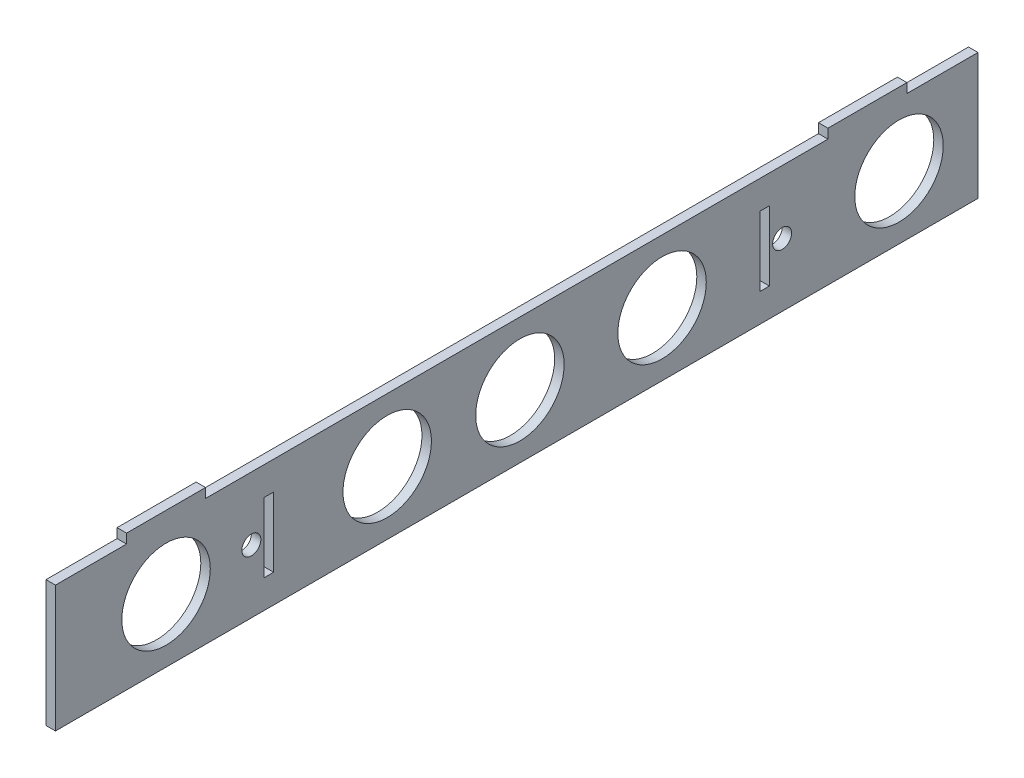
ISO-10303-21;
HEADER;
FILE_DESCRIPTION(('STEP AP214'),'2;1');
FILE_NAME('part.step','',(''),(''),'','','');
FILE_SCHEMA(('AUTOMOTIVE_DESIGN { 1 0 10303 214 1 1 1 1 }'));
ENDSEC;
DATA;
#1=APPLICATION_CONTEXT('core data for automotive mechanical design processes');
#2=APPLICATION_PROTOCOL_DEFINITION('international standard','automotive_design',2000,#1);
#3=PRODUCT_CONTEXT('',#1,'mechanical');
#4=PRODUCT('Part','Part','',(#3));
#5=PRODUCT_RELATED_PRODUCT_CATEGORY('part','',(#4));
#6=PRODUCT_DEFINITION_FORMATION('','',#4);
#7=PRODUCT_DEFINITION_CONTEXT('part definition',#1,'design');
#8=PRODUCT_DEFINITION('design','',#6,#7);
#9=PRODUCT_DEFINITION_SHAPE('','',#8);
#10=(LENGTH_UNIT() NAMED_UNIT(*) SI_UNIT(.MILLI.,.METRE.));
#11=(NAMED_UNIT(*) PLANE_ANGLE_UNIT() SI_UNIT($,.RADIAN.));
#12=(NAMED_UNIT(*) SI_UNIT($,.STERADIAN.) SOLID_ANGLE_UNIT());
#13=UNCERTAINTY_MEASURE_WITH_UNIT(LENGTH_MEASURE(1.E-05),#10,'distance_accuracy_value','');
#14=(GEOMETRIC_REPRESENTATION_CONTEXT(3) GLOBAL_UNCERTAINTY_ASSIGNED_CONTEXT((#13)) GLOBAL_UNIT_ASSIGNED_CONTEXT((#10,
#11,#12)) REPRESENTATION_CONTEXT('',''));
#15=CARTESIAN_POINT('',(0.,0.,0.));
#16=DIRECTION('',(0.,0.,1.));
#17=DIRECTION('',(1.,0.,0.));
#18=AXIS2_PLACEMENT_3D('',#15,#16,#17);
#19=CARTESIAN_POINT('',(3.,-9.,0.));
#20=DIRECTION('',(0.,1.,0.));
#21=DIRECTION('',(0.,0.,1.));
#22=AXIS2_PLACEMENT_3D('',#19,#20,#21);
#23=PLANE('',#22);
#24=DIRECTION('',(0.,0.,-1.));
#25=VECTOR('',#24,1.);
#26=CARTESIAN_POINT('',(0.,-9.,0.));
#27=LINE('',#26,#25);
#28=CARTESIAN_POINT('',(0.,-9.,-222.96));
#29=VERTEX_POINT('',#28);
#30=CARTESIAN_POINT('',(0.,-9.,-225.96));
#31=VERTEX_POINT('',#30);
#32=EDGE_CURVE('E251',#29,#31,#27,.T.);
#33=ORIENTED_EDGE('',*,*,#32,.T.);
#34=DIRECTION('',(-1.,0.,0.));
#35=VECTOR('',#34,1.);
#36=CARTESIAN_POINT('',(3.,-9.,-225.96));
#37=LINE('',#36,#35);
#38=CARTESIAN_POINT('',(3.,-9.,-225.96));
#39=VERTEX_POINT('',#38);
#40=EDGE_CURVE('E11',#39,#31,#37,.T.);
#41=ORIENTED_EDGE('',*,*,#40,.F.);
#42=DIRECTION('',(0.,0.,-1.));
#43=VECTOR('',#42,1.);
#44=CARTESIAN_POINT('',(3.,-9.,0.));
#45=LINE('',#44,#43);
#46=CARTESIAN_POINT('',(3.,-9.,-222.96));
#47=VERTEX_POINT('',#46);
#48=EDGE_CURVE('E190',#47,#39,#45,.T.);
#49=ORIENTED_EDGE('',*,*,#48,.F.);
#50=DIRECTION('',(-1.,0.,0.));
#51=VECTOR('',#50,1.);
#52=CARTESIAN_POINT('',(3.,-9.,-222.96));
#53=LINE('',#52,#51);
#54=EDGE_CURVE('E57',#47,#29,#53,.T.);
#55=ORIENTED_EDGE('',*,*,#54,.T.);
#56=EDGE_LOOP('',(#33,#41,#49,#55));
#57=FACE_BOUND('',#56,.T.);
#58=ADVANCED_FACE('F38',(#57),#23,.F.);
#59=CARTESIAN_POINT('',(3.,0.,-225.96));
#60=DIRECTION('',(0.,0.,-1.));
#61=DIRECTION('',(-1.,0.,0.));
#62=AXIS2_PLACEMENT_3D('',#59,#60,#61);
#63=PLANE('',#62);
#64=DIRECTION('',(0.,-1.,0.));
#65=VECTOR('',#64,1.);
#66=CARTESIAN_POINT('',(0.,0.,-225.96));
#67=LINE('',#66,#65);
#68=CARTESIAN_POINT('',(0.,-31.,-225.96));
#69=VERTEX_POINT('',#68);
#70=EDGE_CURVE('E196',#31,#69,#67,.T.);
#71=ORIENTED_EDGE('',*,*,#70,.T.);
#72=DIRECTION('',(-1.,0.,0.));
#73=VECTOR('',#72,1.);
#74=CARTESIAN_POINT('',(3.,-31.,-225.96));
#75=LINE('',#74,#73);
#76=CARTESIAN_POINT('',(3.,-31.,-225.96));
#77=VERTEX_POINT('',#76);
#78=EDGE_CURVE('E48',#77,#69,#75,.T.);
#79=ORIENTED_EDGE('',*,*,#78,.F.);
#80=DIRECTION('',(0.,-1.,0.));
#81=VECTOR('',#80,1.);
#82=CARTESIAN_POINT('',(3.,0.,-225.96));
#83=LINE('',#82,#81);
#84=EDGE_CURVE('E184',#39,#77,#83,.T.);
#85=ORIENTED_EDGE('',*,*,#84,.F.);
#86=ORIENTED_EDGE('',*,*,#40,.T.);
#87=EDGE_LOOP('',(#71,#79,#85,#86));
#88=FACE_BOUND('',#87,.T.);
#89=ADVANCED_FACE('F195',(#88),#63,.F.);
#90=CARTESIAN_POINT('',(3.,-31.,0.));
#91=DIRECTION('',(0.,1.,0.));
#92=DIRECTION('',(0.,0.,1.));
#93=AXIS2_PLACEMENT_3D('',#90,#91,#92);
#94=PLANE('',#93);
#95=DIRECTION('',(0.,0.,-1.));
#96=VECTOR('',#95,1.);
#97=CARTESIAN_POINT('',(0.,-31.,0.));
#98=LINE('',#97,#96);
#99=CARTESIAN_POINT('',(0.,-31.,-222.96));
#100=VERTEX_POINT('',#99);
#101=EDGE_CURVE('E254',#100,#69,#98,.T.);
#102=ORIENTED_EDGE('',*,*,#101,.F.);
#103=DIRECTION('',(-1.,0.,0.));
#104=VECTOR('',#103,1.);
#105=CARTESIAN_POINT('',(3.,-31.,-222.96));
#106=LINE('',#105,#104);
#107=CARTESIAN_POINT('',(3.,-31.,-222.96));
#108=VERTEX_POINT('',#107);
#109=EDGE_CURVE('E119',#108,#100,#106,.T.);
#110=ORIENTED_EDGE('',*,*,#109,.F.);
#111=DIRECTION('',(0.,0.,-1.));
#112=VECTOR('',#111,1.);
#113=CARTESIAN_POINT('',(3.,-31.,0.));
#114=LINE('',#113,#112);
#115=EDGE_CURVE('E189',#108,#77,#114,.T.);
#116=ORIENTED_EDGE('',*,*,#115,.T.);
#117=ORIENTED_EDGE('',*,*,#78,.T.);
#118=EDGE_LOOP('',(#102,#110,#116,#117));
#119=FACE_BOUND('',#118,.T.);
#120=ADVANCED_FACE('F200',(#119),#94,.T.);
#121=CARTESIAN_POINT('',(3.,-9.,0.));
#122=DIRECTION('',(0.,1.,0.));
#123=DIRECTION('',(0.,0.,1.));
#124=AXIS2_PLACEMENT_3D('',#121,#122,#123);
#125=PLANE('',#124);
#126=DIRECTION('',(0.,0.,-1.));
#127=VECTOR('',#126,1.);
#128=CARTESIAN_POINT('',(0.,-9.,0.));
#129=LINE('',#128,#127);
#130=CARTESIAN_POINT('',(0.,-9.,-66.04));
#131=VERTEX_POINT('',#130);
#132=CARTESIAN_POINT('',(0.,-9.,-69.04));
#133=VERTEX_POINT('',#132);
#134=EDGE_CURVE('E239',#131,#133,#129,.T.);
#135=ORIENTED_EDGE('',*,*,#134,.T.);
#136=DIRECTION('',(-1.,0.,0.));
#137=VECTOR('',#136,1.);
#138=CARTESIAN_POINT('',(3.,-9.,-69.04));
#139=LINE('',#138,#137);
#140=CARTESIAN_POINT('',(3.,-9.,-69.04));
#141=VERTEX_POINT('',#140);
#142=EDGE_CURVE('E261',#141,#133,#139,.T.);
#143=ORIENTED_EDGE('',*,*,#142,.F.);
#144=DIRECTION('',(0.,0.,-1.));
#145=VECTOR('',#144,1.);
#146=CARTESIAN_POINT('',(3.,-9.,0.));
#147=LINE('',#146,#145);
#148=CARTESIAN_POINT('',(3.,-9.,-66.04));
#149=VERTEX_POINT('',#148);
#150=EDGE_CURVE('E362',#149,#141,#147,.T.);
#151=ORIENTED_EDGE('',*,*,#150,.F.);
#152=DIRECTION('',(-1.,0.,0.));
#153=VECTOR('',#152,1.);
#154=CARTESIAN_POINT('',(3.,-9.,-66.04));
#155=LINE('',#154,#153);
#156=EDGE_CURVE('E263',#149,#131,#155,.T.);
#157=ORIENTED_EDGE('',*,*,#156,.T.);
#158=EDGE_LOOP('',(#135,#143,#151,#157));
#159=FACE_BOUND('',#158,.T.);
#160=ADVANCED_FACE('F389',(#159),#125,.F.);
#161=CARTESIAN_POINT('',(3.,0.,-69.04));
#162=DIRECTION('',(0.,0.,-1.));
#163=DIRECTION('',(-1.,0.,0.));
#164=AXIS2_PLACEMENT_3D('',#161,#162,#163);
#165=PLANE('',#164);
#166=DIRECTION('',(0.,-1.,0.));
#167=VECTOR('',#166,1.);
#168=CARTESIAN_POINT('',(0.,0.,-69.04));
#169=LINE('',#168,#167);
#170=CARTESIAN_POINT('',(0.,-31.,-69.04));
#171=VERTEX_POINT('',#170);
#172=EDGE_CURVE('E242',#133,#171,#169,.T.);
#173=ORIENTED_EDGE('',*,*,#172,.T.);
#174=DIRECTION('',(-1.,0.,0.));
#175=VECTOR('',#174,1.);
#176=CARTESIAN_POINT('',(3.,-31.,-69.04));
#177=LINE('',#176,#175);
#178=CARTESIAN_POINT('',(3.,-31.,-69.04));
#179=VERTEX_POINT('',#178);
#180=EDGE_CURVE('E267',#179,#171,#177,.T.);
#181=ORIENTED_EDGE('',*,*,#180,.F.);
#182=DIRECTION('',(0.,-1.,0.));
#183=VECTOR('',#182,1.);
#184=CARTESIAN_POINT('',(3.,0.,-69.04));
#185=LINE('',#184,#183);
#186=EDGE_CURVE('E365',#141,#179,#185,.T.);
#187=ORIENTED_EDGE('',*,*,#186,.F.);
#188=ORIENTED_EDGE('',*,*,#142,.T.);
#189=EDGE_LOOP('',(#173,#181,#187,#188));
#190=FACE_BOUND('',#189,.T.);
#191=ADVANCED_FACE('F391',(#190),#165,.F.);
#192=CARTESIAN_POINT('',(3.,-31.,0.));
#193=DIRECTION('',(0.,1.,0.));
#194=DIRECTION('',(0.,0.,1.));
#195=AXIS2_PLACEMENT_3D('',#192,#193,#194);
#196=PLANE('',#195);
#197=DIRECTION('',(0.,0.,-1.));
#198=VECTOR('',#197,1.);
#199=CARTESIAN_POINT('',(0.,-31.,0.));
#200=LINE('',#199,#198);
#201=CARTESIAN_POINT('',(0.,-31.,-66.04));
#202=VERTEX_POINT('',#201);
#203=EDGE_CURVE('E245',#202,#171,#200,.T.);
#204=ORIENTED_EDGE('',*,*,#203,.F.);
#205=DIRECTION('',(-1.,0.,0.));
#206=VECTOR('',#205,1.);
#207=CARTESIAN_POINT('',(3.,-31.,-66.04));
#208=LINE('',#207,#206);
#209=CARTESIAN_POINT('',(3.,-31.,-66.04));
#210=VERTEX_POINT('',#209);
#211=EDGE_CURVE('E265',#210,#202,#208,.T.);
#212=ORIENTED_EDGE('',*,*,#211,.F.);
#213=DIRECTION('',(0.,0.,-1.));
#214=VECTOR('',#213,1.);
#215=CARTESIAN_POINT('',(3.,-31.,0.));
#216=LINE('',#215,#214);
#217=EDGE_CURVE('E367',#210,#179,#216,.T.);
#218=ORIENTED_EDGE('',*,*,#217,.T.);
#219=ORIENTED_EDGE('',*,*,#180,.T.);
#220=EDGE_LOOP('',(#204,#212,#218,#219));
#221=FACE_BOUND('',#220,.T.);
#222=ADVANCED_FACE('F383',(#221),#196,.T.);
#223=CARTESIAN_POINT('',(3.,0.,-292.));
#224=DIRECTION('',(0.,0.,-1.));
#225=DIRECTION('',(-1.,0.,0.));
#226=AXIS2_PLACEMENT_3D('',#223,#224,#225);
#227=PLANE('',#226);
#228=DIRECTION('',(0.,-1.,0.));
#229=VECTOR('',#228,1.);
#230=CARTESIAN_POINT('',(0.,0.,-292.));
#231=LINE('',#230,#229);
#232=CARTESIAN_POINT('',(0.,0.,-292.));
#233=VERTEX_POINT('',#232);
#234=CARTESIAN_POINT('',(0.,-40.,-292.));
#235=VERTEX_POINT('',#234);
#236=EDGE_CURVE('E207',#233,#235,#231,.T.);
#237=ORIENTED_EDGE('',*,*,#236,.F.);
#238=DIRECTION('',(-1.,0.,0.));
#239=VECTOR('',#238,1.);
#240=CARTESIAN_POINT('',(3.,0.,-292.));
#241=LINE('',#240,#239);
#242=CARTESIAN_POINT('',(3.,0.,-292.));
#243=VERTEX_POINT('',#242);
#244=EDGE_CURVE('E131',#243,#233,#241,.T.);
#245=ORIENTED_EDGE('',*,*,#244,.F.);
#246=DIRECTION('',(0.,-1.,0.));
#247=VECTOR('',#246,1.);
#248=CARTESIAN_POINT('',(3.,0.,-292.));
#249=LINE('',#248,#247);
#250=CARTESIAN_POINT('',(3.,-40.,-292.));
#251=VERTEX_POINT('',#250);
#252=EDGE_CURVE('E259',#243,#251,#249,.T.);
#253=ORIENTED_EDGE('',*,*,#252,.T.);
#254=DIRECTION('',(-1.,0.,0.));
#255=VECTOR('',#254,1.);
#256=CARTESIAN_POINT('',(3.,-40.,-292.));
#257=LINE('',#256,#255);
#258=EDGE_CURVE('E203',#251,#235,#257,.T.);
#259=ORIENTED_EDGE('',*,*,#258,.T.);
#260=EDGE_LOOP('',(#237,#245,#253,#259));
#261=FACE_BOUND('',#260,.T.);
#262=ADVANCED_FACE('F40',(#261),#227,.T.);
#263=CARTESIAN_POINT('',(3.,0.,0.));
#264=DIRECTION('',(0.,1.,0.));
#265=DIRECTION('',(0.,0.,1.));
#266=AXIS2_PLACEMENT_3D('',#263,#264,#265);
#267=PLANE('',#266);
#268=DIRECTION('',(0.,0.,-1.));
#269=VECTOR('',#268,1.);
#270=CARTESIAN_POINT('',(0.,0.,0.));
#271=LINE('',#270,#269);
#272=CARTESIAN_POINT('',(0.,0.,-269.5));
#273=VERTEX_POINT('',#272);
#274=EDGE_CURVE('E210',#273,#233,#271,.T.);
#275=ORIENTED_EDGE('',*,*,#274,.F.);
#276=DIRECTION('',(-1.,0.,0.));
#277=VECTOR('',#276,1.);
#278=CARTESIAN_POINT('',(3.,0.,-269.5));
#279=LINE('',#278,#277);
#280=CARTESIAN_POINT('',(3.,0.,-269.5));
#281=VERTEX_POINT('',#280);
#282=EDGE_CURVE('E291',#281,#273,#279,.T.);
#283=ORIENTED_EDGE('',*,*,#282,.F.);
#284=DIRECTION('',(0.,0.,-1.));
#285=VECTOR('',#284,1.);
#286=CARTESIAN_POINT('',(3.,0.,0.));
#287=LINE('',#286,#285);
#288=EDGE_CURVE('E337',#281,#243,#287,.T.);
#289=ORIENTED_EDGE('',*,*,#288,.T.);
#290=ORIENTED_EDGE('',*,*,#244,.T.);
#291=EDGE_LOOP('',(#275,#283,#289,#290));
#292=FACE_BOUND('',#291,.T.);
#293=ADVANCED_FACE('F427',(#292),#267,.T.);
#294=CARTESIAN_POINT('',(3.,0.,-269.5));
#295=DIRECTION('',(0.,0.,1.));
#296=DIRECTION('',(1.,0.,0.));
#297=AXIS2_PLACEMENT_3D('',#294,#295,#296);
#298=PLANE('',#297);
#299=DIRECTION('',(0.,1.,0.));
#300=VECTOR('',#299,1.);
#301=CARTESIAN_POINT('',(0.,0.,-269.5));
#302=LINE('',#301,#300);
#303=CARTESIAN_POINT('',(0.,3.,-269.5));
#304=VERTEX_POINT('',#303);
#305=EDGE_CURVE('E214',#273,#304,#302,.T.);
#306=ORIENTED_EDGE('',*,*,#305,.T.);
#307=DIRECTION('',(-1.,0.,0.));
#308=VECTOR('',#307,1.);
#309=CARTESIAN_POINT('',(3.,3.,-269.5));
#310=LINE('',#309,#308);
#311=CARTESIAN_POINT('',(3.,3.,-269.5));
#312=VERTEX_POINT('',#311);
#313=EDGE_CURVE('E289',#312,#304,#310,.T.);
#314=ORIENTED_EDGE('',*,*,#313,.F.);
#315=DIRECTION('',(0.,1.,0.));
#316=VECTOR('',#315,1.);
#317=CARTESIAN_POINT('',(3.,0.,-269.5));
#318=LINE('',#317,#316);
#319=EDGE_CURVE('E340',#281,#312,#318,.T.);
#320=ORIENTED_EDGE('',*,*,#319,.F.);
#321=ORIENTED_EDGE('',*,*,#282,.T.);
#322=EDGE_LOOP('',(#306,#314,#320,#321));
#323=FACE_BOUND('',#322,.T.);
#324=ADVANCED_FACE('F447',(#323),#298,.F.);
#325=CARTESIAN_POINT('',(3.,2.99999999999997,0.));
#326=DIRECTION('',(0.,1.,0.));
#327=DIRECTION('',(0.,0.,1.));
#328=AXIS2_PLACEMENT_3D('',#325,#326,#327);
#329=PLANE('',#328);
#330=DIRECTION('',(0.,0.,-1.));
#331=VECTOR('',#330,1.);
#332=CARTESIAN_POINT('',(0.,2.99999999999997,0.));
#333=LINE('',#332,#331);
#334=CARTESIAN_POINT('',(0.,3.,-244.5));
#335=VERTEX_POINT('',#334);
#336=EDGE_CURVE('E219',#335,#304,#333,.T.);
#337=ORIENTED_EDGE('',*,*,#336,.F.);
#338=DIRECTION('',(-1.,0.,0.));
#339=VECTOR('',#338,1.);
#340=CARTESIAN_POINT('',(3.,3.,-244.5));
#341=LINE('',#340,#339);
#342=CARTESIAN_POINT('',(3.,3.,-244.5));
#343=VERTEX_POINT('',#342);
#344=EDGE_CURVE('E287',#343,#335,#341,.T.);
#345=ORIENTED_EDGE('',*,*,#344,.F.);
#346=DIRECTION('',(0.,0.,-1.));
#347=VECTOR('',#346,1.);
#348=CARTESIAN_POINT('',(3.,2.99999999999997,0.));
#349=LINE('',#348,#347);
#350=EDGE_CURVE('E344',#343,#312,#349,.T.);
#351=ORIENTED_EDGE('',*,*,#350,.T.);
#352=ORIENTED_EDGE('',*,*,#313,.T.);
#353=EDGE_LOOP('',(#337,#345,#351,#352));
#354=FACE_BOUND('',#353,.T.);
#355=ADVANCED_FACE('F444',(#354),#329,.T.);
#356=CARTESIAN_POINT('',(3.,0.,-244.5));
#357=DIRECTION('',(0.,0.,1.));
#358=DIRECTION('',(1.,0.,0.));
#359=AXIS2_PLACEMENT_3D('',#356,#357,#358);
#360=PLANE('',#359);
#361=DIRECTION('',(0.,1.,0.));
#362=VECTOR('',#361,1.);
#363=CARTESIAN_POINT('',(0.,0.,-244.5));
#364=LINE('',#363,#362);
#365=CARTESIAN_POINT('',(0.,0.,-244.5));
#366=VERTEX_POINT('',#365);
#367=EDGE_CURVE('E222',#366,#335,#364,.T.);
#368=ORIENTED_EDGE('',*,*,#367,.F.);
#369=DIRECTION('',(-1.,0.,0.));
#370=VECTOR('',#369,1.);
#371=CARTESIAN_POINT('',(3.,0.,-244.5));
#372=LINE('',#371,#370);
#373=CARTESIAN_POINT('',(3.,0.,-244.5));
#374=VERTEX_POINT('',#373);
#375=EDGE_CURVE('E285',#374,#366,#372,.T.);
#376=ORIENTED_EDGE('',*,*,#375,.F.);
#377=DIRECTION('',(0.,1.,0.));
#378=VECTOR('',#377,1.);
#379=CARTESIAN_POINT('',(3.,0.,-244.5));
#380=LINE('',#379,#378);
#381=EDGE_CURVE('E347',#374,#343,#380,.T.);
#382=ORIENTED_EDGE('',*,*,#381,.T.);
#383=ORIENTED_EDGE('',*,*,#344,.T.);
#384=EDGE_LOOP('',(#368,#376,#382,#383));
#385=FACE_BOUND('',#384,.T.);
#386=ADVANCED_FACE('F441',(#385),#360,.T.);
#387=CARTESIAN_POINT('',(0.,0.,-47.5));
#388=VERTEX_POINT('',#387);
#389=EDGE_CURVE('E216',#388,#366,#271,.T.);
#390=ORIENTED_EDGE('',*,*,#389,.F.);
#391=DIRECTION('',(-1.,0.,0.));
#392=VECTOR('',#391,1.);
#393=CARTESIAN_POINT('',(3.,0.,-47.5));
#394=LINE('',#393,#392);
#395=CARTESIAN_POINT('',(3.,0.,-47.5));
#396=VERTEX_POINT('',#395);
#397=EDGE_CURVE('E283',#396,#388,#394,.T.);
#398=ORIENTED_EDGE('',*,*,#397,.F.);
#399=EDGE_CURVE('E342',#396,#374,#287,.T.);
#400=ORIENTED_EDGE('',*,*,#399,.T.);
#401=ORIENTED_EDGE('',*,*,#375,.T.);
#402=EDGE_LOOP('',(#390,#398,#400,#401));
#403=FACE_BOUND('',#402,.T.);
#404=ADVANCED_FACE('F428',(#403),#267,.T.);
#405=CARTESIAN_POINT('',(3.,0.,-47.5));
#406=DIRECTION('',(0.,0.,1.));
#407=DIRECTION('',(1.,0.,0.));
#408=AXIS2_PLACEMENT_3D('',#405,#406,#407);
#409=PLANE('',#408);
#410=DIRECTION('',(0.,1.,0.));
#411=VECTOR('',#410,1.);
#412=CARTESIAN_POINT('',(0.,0.,-47.5));
#413=LINE('',#412,#411);
#414=CARTESIAN_POINT('',(0.,3.,-47.5));
#415=VERTEX_POINT('',#414);
#416=EDGE_CURVE('E225',#388,#415,#413,.T.);
#417=ORIENTED_EDGE('',*,*,#416,.T.);
#418=DIRECTION('',(-1.,0.,0.));
#419=VECTOR('',#418,1.);
#420=CARTESIAN_POINT('',(3.,3.,-47.5));
#421=LINE('',#420,#419);
#422=CARTESIAN_POINT('',(3.,3.,-47.5));
#423=VERTEX_POINT('',#422);
#424=EDGE_CURVE('E281',#423,#415,#421,.T.);
#425=ORIENTED_EDGE('',*,*,#424,.F.);
#426=DIRECTION('',(0.,1.,0.));
#427=VECTOR('',#426,1.);
#428=CARTESIAN_POINT('',(3.,0.,-47.5));
#429=LINE('',#428,#427);
#430=EDGE_CURVE('E350',#396,#423,#429,.T.);
#431=ORIENTED_EDGE('',*,*,#430,.F.);
#432=ORIENTED_EDGE('',*,*,#397,.T.);
#433=EDGE_LOOP('',(#417,#425,#431,#432));
#434=FACE_BOUND('',#433,.T.);
#435=ADVANCED_FACE('F436',(#434),#409,.F.);
#436=CARTESIAN_POINT('',(3.,3.,0.));
#437=DIRECTION('',(0.,1.,0.));
#438=DIRECTION('',(0.,0.,1.));
#439=AXIS2_PLACEMENT_3D('',#436,#437,#438);
#440=PLANE('',#439);
#441=DIRECTION('',(0.,0.,-1.));
#442=VECTOR('',#441,1.);
#443=CARTESIAN_POINT('',(0.,3.,0.));
#444=LINE('',#443,#442);
#445=CARTESIAN_POINT('',(0.,3.,-22.5));
#446=VERTEX_POINT('',#445);
#447=EDGE_CURVE('E228',#446,#415,#444,.T.);
#448=ORIENTED_EDGE('',*,*,#447,.F.);
#449=DIRECTION('',(-1.,0.,0.));
#450=VECTOR('',#449,1.);
#451=CARTESIAN_POINT('',(3.,3.,-22.5));
#452=LINE('',#451,#450);
#453=CARTESIAN_POINT('',(3.,3.,-22.5));
#454=VERTEX_POINT('',#453);
#455=EDGE_CURVE('E279',#454,#446,#452,.T.);
#456=ORIENTED_EDGE('',*,*,#455,.F.);
#457=DIRECTION('',(0.,0.,-1.));
#458=VECTOR('',#457,1.);
#459=CARTESIAN_POINT('',(3.,3.,0.));
#460=LINE('',#459,#458);
#461=EDGE_CURVE('E352',#454,#423,#460,.T.);
#462=ORIENTED_EDGE('',*,*,#461,.T.);
#463=ORIENTED_EDGE('',*,*,#424,.T.);
#464=EDGE_LOOP('',(#448,#456,#462,#463));
#465=FACE_BOUND('',#464,.T.);
#466=ADVANCED_FACE('F432',(#465),#440,.T.);
#467=CARTESIAN_POINT('',(3.,0.,-22.5));
#468=DIRECTION('',(0.,0.,1.));
#469=DIRECTION('',(1.,0.,0.));
#470=AXIS2_PLACEMENT_3D('',#467,#468,#469);
#471=PLANE('',#470);
#472=DIRECTION('',(0.,1.,0.));
#473=VECTOR('',#472,1.);
#474=CARTESIAN_POINT('',(0.,0.,-22.5));
#475=LINE('',#474,#473);
#476=CARTESIAN_POINT('',(0.,0.,-22.5));
#477=VERTEX_POINT('',#476);
#478=EDGE_CURVE('E231',#477,#446,#475,.T.);
#479=ORIENTED_EDGE('',*,*,#478,.F.);
#480=DIRECTION('',(-1.,0.,0.));
#481=VECTOR('',#480,1.);
#482=CARTESIAN_POINT('',(3.,0.,-22.5));
#483=LINE('',#482,#481);
#484=CARTESIAN_POINT('',(3.,0.,-22.5));
#485=VERTEX_POINT('',#484);
#486=EDGE_CURVE('E277',#485,#477,#483,.T.);
#487=ORIENTED_EDGE('',*,*,#486,.F.);
#488=DIRECTION('',(0.,1.,0.));
#489=VECTOR('',#488,1.);
#490=CARTESIAN_POINT('',(3.,0.,-22.5));
#491=LINE('',#490,#489);
#492=EDGE_CURVE('E355',#485,#454,#491,.T.);
#493=ORIENTED_EDGE('',*,*,#492,.T.);
#494=ORIENTED_EDGE('',*,*,#455,.T.);
#495=EDGE_LOOP('',(#479,#487,#493,#494));
#496=FACE_BOUND('',#495,.T.);
#497=ADVANCED_FACE('F424',(#496),#471,.T.);
#498=CARTESIAN_POINT('',(0.,0.,0.));
#499=VERTEX_POINT('',#498);
#500=EDGE_CURVE('E215',#499,#477,#271,.T.);
#501=ORIENTED_EDGE('',*,*,#500,.F.);
#502=DIRECTION('',(-1.,0.,0.));
#503=VECTOR('',#502,1.);
#504=CARTESIAN_POINT('',(3.,0.,0.));
#505=LINE('',#504,#503);
#506=CARTESIAN_POINT('',(3.,0.,0.));
#507=VERTEX_POINT('',#506);
#508=EDGE_CURVE('E275',#507,#499,#505,.T.);
#509=ORIENTED_EDGE('',*,*,#508,.F.);
#510=EDGE_CURVE('E341',#507,#485,#287,.T.);
#511=ORIENTED_EDGE('',*,*,#510,.T.);
#512=ORIENTED_EDGE('',*,*,#486,.T.);
#513=EDGE_LOOP('',(#501,#509,#511,#512));
#514=FACE_BOUND('',#513,.T.);
#515=ADVANCED_FACE('F418',(#514),#267,.T.);
#516=CARTESIAN_POINT('',(3.,0.,0.));
#517=DIRECTION('',(0.,0.,-1.));
#518=DIRECTION('',(-1.,0.,0.));
#519=AXIS2_PLACEMENT_3D('',#516,#517,#518);
#520=PLANE('',#519);
#521=DIRECTION('',(0.,-1.,0.));
#522=VECTOR('',#521,1.);
#523=CARTESIAN_POINT('',(0.,0.,0.));
#524=LINE('',#523,#522);
#525=CARTESIAN_POINT('',(0.,-40.,0.));
#526=VERTEX_POINT('',#525);
#527=EDGE_CURVE('E234',#499,#526,#524,.T.);
#528=ORIENTED_EDGE('',*,*,#527,.T.);
#529=DIRECTION('',(-1.,0.,0.));
#530=VECTOR('',#529,1.);
#531=CARTESIAN_POINT('',(3.,-40.,0.));
#532=LINE('',#531,#530);
#533=CARTESIAN_POINT('',(3.,-40.,0.));
#534=VERTEX_POINT('',#533);
#535=EDGE_CURVE('E272',#534,#526,#532,.T.);
#536=ORIENTED_EDGE('',*,*,#535,.F.);
#537=DIRECTION('',(0.,-1.,0.));
#538=VECTOR('',#537,1.);
#539=CARTESIAN_POINT('',(3.,0.,0.));
#540=LINE('',#539,#538);
#541=EDGE_CURVE('E358',#507,#534,#540,.T.);
#542=ORIENTED_EDGE('',*,*,#541,.F.);
#543=ORIENTED_EDGE('',*,*,#508,.T.);
#544=EDGE_LOOP('',(#528,#536,#542,#543));
#545=FACE_BOUND('',#544,.T.);
#546=ADVANCED_FACE('F410',(#545),#520,.F.);
#547=CARTESIAN_POINT('',(3.,0.,-66.04));
#548=DIRECTION('',(0.,0.,-1.));
#549=DIRECTION('',(-1.,0.,0.));
#550=AXIS2_PLACEMENT_3D('',#547,#548,#549);
#551=PLANE('',#550);
#552=DIRECTION('',(0.,-1.,0.));
#553=VECTOR('',#552,1.);
#554=CARTESIAN_POINT('',(0.,0.,-66.04));
#555=LINE('',#554,#553);
#556=EDGE_CURVE('E248',#131,#202,#555,.T.);
#557=ORIENTED_EDGE('',*,*,#556,.F.);
#558=ORIENTED_EDGE('',*,*,#156,.F.);
#559=DIRECTION('',(0.,-1.,0.));
#560=VECTOR('',#559,1.);
#561=CARTESIAN_POINT('',(3.,0.,-66.04));
#562=LINE('',#561,#560);
#563=EDGE_CURVE('E370',#149,#210,#562,.T.);
#564=ORIENTED_EDGE('',*,*,#563,.T.);
#565=ORIENTED_EDGE('',*,*,#211,.T.);
#566=EDGE_LOOP('',(#557,#558,#564,#565));
#567=FACE_BOUND('',#566,.T.);
#568=ADVANCED_FACE('F375',(#567),#551,.T.);
#569=CARTESIAN_POINT('',(3.,-40.,0.));
#570=DIRECTION('',(0.,1.,0.));
#571=DIRECTION('',(0.,0.,1.));
#572=AXIS2_PLACEMENT_3D('',#569,#570,#571);
#573=PLANE('',#572);
#574=DIRECTION('',(0.,0.,-1.));
#575=VECTOR('',#574,1.);
#576=CARTESIAN_POINT('',(0.,-40.,0.));
#577=LINE('',#576,#575);
#578=EDGE_CURVE('E236',#526,#235,#577,.T.);
#579=ORIENTED_EDGE('',*,*,#578,.T.);
#580=ORIENTED_EDGE('',*,*,#258,.F.);
#581=DIRECTION('',(0.,0.,-1.));
#582=VECTOR('',#581,1.);
#583=CARTESIAN_POINT('',(3.,-40.,0.));
#584=LINE('',#583,#582);
#585=EDGE_CURVE('E360',#534,#251,#584,.T.);
#586=ORIENTED_EDGE('',*,*,#585,.F.);
#587=ORIENTED_EDGE('',*,*,#535,.T.);
#588=EDGE_LOOP('',(#579,#580,#586,#587));
#589=FACE_BOUND('',#588,.T.);
#590=ADVANCED_FACE('F409',(#589),#573,.F.);
#591=CARTESIAN_POINT('',(3.,0.,-222.96));
#592=DIRECTION('',(0.,0.,-1.));
#593=DIRECTION('',(-1.,0.,0.));
#594=AXIS2_PLACEMENT_3D('',#591,#592,#593);
#595=PLANE('',#594);
#596=DIRECTION('',(0.,-1.,0.));
#597=VECTOR('',#596,1.);
#598=CARTESIAN_POINT('',(0.,0.,-222.96));
#599=LINE('',#598,#597);
#600=EDGE_CURVE('E256',#29,#100,#599,.T.);
#601=ORIENTED_EDGE('',*,*,#600,.F.);
#602=ORIENTED_EDGE('',*,*,#54,.F.);
#603=DIRECTION('',(0.,-1.,0.));
#604=VECTOR('',#603,1.);
#605=CARTESIAN_POINT('',(3.,0.,-222.96));
#606=LINE('',#605,#604);
#607=EDGE_CURVE('E201',#47,#108,#606,.T.);
#608=ORIENTED_EDGE('',*,*,#607,.T.);
#609=ORIENTED_EDGE('',*,*,#109,.T.);
#610=EDGE_LOOP('',(#601,#602,#608,#609));
#611=FACE_BOUND('',#610,.T.);
#612=ADVANCED_FACE('F415',(#611),#595,.T.);
#613=CARTESIAN_POINT('',(3.,0.,0.));
#614=DIRECTION('',(1.,0.,0.));
#615=DIRECTION('',(0.,0.,-1.));
#616=AXIS2_PLACEMENT_3D('',#613,#614,#615);
#617=PLANE('',#616);
#618=CARTESIAN_POINT('',(3.,-20.,-62.));
#619=DIRECTION('',(1.,0.,0.));
#620=DIRECTION('',(0.,0.,-1.));
#621=AXIS2_PLACEMENT_3D('',#618,#619,#620);
#622=CIRCLE('',#621,3.00000000000001);
#623=CARTESIAN_POINT('',(3.,-20.,-65.));
#624=VERTEX_POINT('',#623);
#625=EDGE_CURVE('E310',#624,#624,#622,.T.);
#626=ORIENTED_EDGE('',*,*,#625,.F.);
#627=EDGE_LOOP('',(#626));
#628=FACE_BOUND('',#627,.T.);
#629=CARTESIAN_POINT('',(3.,-20.,-230.));
#630=DIRECTION('',(1.,0.,0.));
#631=DIRECTION('',(0.,0.,-1.));
#632=AXIS2_PLACEMENT_3D('',#629,#630,#631);
#633=CIRCLE('',#632,2.99999999999999);
#634=CARTESIAN_POINT('',(3.,-20.,-233.));
#635=VERTEX_POINT('',#634);
#636=EDGE_CURVE('E316',#635,#635,#633,.T.);
#637=ORIENTED_EDGE('',*,*,#636,.F.);
#638=EDGE_LOOP('',(#637));
#639=FACE_BOUND('',#638,.T.);
#640=CARTESIAN_POINT('',(3.,-20.,-35.));
#641=DIRECTION('',(1.,0.,0.));
#642=DIRECTION('',(0.,0.,-1.));
#643=AXIS2_PLACEMENT_3D('',#640,#641,#642);
#644=CIRCLE('',#643,14.);
#645=CARTESIAN_POINT('',(3.,-20.,-49.));
#646=VERTEX_POINT('',#645);
#647=EDGE_CURVE('E298',#646,#646,#644,.T.);
#648=ORIENTED_EDGE('',*,*,#647,.F.);
#649=EDGE_LOOP('',(#648));
#650=FACE_BOUND('',#649,.T.);
#651=CARTESIAN_POINT('',(3.,-20.,-105.));
#652=DIRECTION('',(1.,0.,0.));
#653=DIRECTION('',(0.,0.,-1.));
#654=AXIS2_PLACEMENT_3D('',#651,#652,#653);
#655=CIRCLE('',#654,14.);
#656=CARTESIAN_POINT('',(3.,-20.,-119.));
#657=VERTEX_POINT('',#656);
#658=EDGE_CURVE('E325',#657,#657,#655,.T.);
#659=ORIENTED_EDGE('',*,*,#658,.F.);
#660=EDGE_LOOP('',(#659));
#661=FACE_BOUND('',#660,.T.);
#662=CARTESIAN_POINT('',(3.,-20.,-147.));
#663=DIRECTION('',(1.,0.,0.));
#664=DIRECTION('',(0.,0.,-1.));
#665=AXIS2_PLACEMENT_3D('',#662,#663,#664);
#666=CIRCLE('',#665,14.);
#667=CARTESIAN_POINT('',(3.,-20.,-161.));
#668=VERTEX_POINT('',#667);
#669=EDGE_CURVE('E328',#668,#668,#666,.T.);
#670=ORIENTED_EDGE('',*,*,#669,.F.);
#671=EDGE_LOOP('',(#670));
#672=FACE_BOUND('',#671,.T.);
#673=CARTESIAN_POINT('',(3.,-20.,-192.));
#674=DIRECTION('',(1.,0.,0.));
#675=DIRECTION('',(0.,0.,-1.));
#676=AXIS2_PLACEMENT_3D('',#673,#674,#675);
#677=CIRCLE('',#676,14.);
#678=CARTESIAN_POINT('',(3.,-20.,-206.));
#679=VERTEX_POINT('',#678);
#680=EDGE_CURVE('E331',#679,#679,#677,.T.);
#681=ORIENTED_EDGE('',*,*,#680,.F.);
#682=EDGE_LOOP('',(#681));
#683=FACE_BOUND('',#682,.T.);
#684=CARTESIAN_POINT('',(3.,-20.,-267.));
#685=DIRECTION('',(1.,0.,0.));
#686=DIRECTION('',(0.,0.,-1.));
#687=AXIS2_PLACEMENT_3D('',#684,#685,#686);
#688=CIRCLE('',#687,14.);
#689=CARTESIAN_POINT('',(3.,-20.,-281.));
#690=VERTEX_POINT('',#689);
#691=EDGE_CURVE('E314',#690,#690,#688,.T.);
#692=ORIENTED_EDGE('',*,*,#691,.F.);
#693=EDGE_LOOP('',(#692));
#694=FACE_BOUND('',#693,.T.);
#695=ORIENTED_EDGE('',*,*,#252,.F.);
#696=ORIENTED_EDGE('',*,*,#288,.F.);
#697=ORIENTED_EDGE('',*,*,#319,.T.);
#698=ORIENTED_EDGE('',*,*,#350,.F.);
#699=ORIENTED_EDGE('',*,*,#381,.F.);
#700=ORIENTED_EDGE('',*,*,#399,.F.);
#701=ORIENTED_EDGE('',*,*,#430,.T.);
#702=ORIENTED_EDGE('',*,*,#461,.F.);
#703=ORIENTED_EDGE('',*,*,#492,.F.);
#704=ORIENTED_EDGE('',*,*,#510,.F.);
#705=ORIENTED_EDGE('',*,*,#541,.T.);
#706=ORIENTED_EDGE('',*,*,#585,.T.);
#707=EDGE_LOOP('',(#695,#696,#697,#698,#699,#700,#701,#702,#703,#704,#705,#706));
#708=FACE_BOUND('',#707,.T.);
#709=ORIENTED_EDGE('',*,*,#150,.T.);
#710=ORIENTED_EDGE('',*,*,#186,.T.);
#711=ORIENTED_EDGE('',*,*,#217,.F.);
#712=ORIENTED_EDGE('',*,*,#563,.F.);
#713=EDGE_LOOP('',(#709,#710,#711,#712));
#714=FACE_BOUND('',#713,.T.);
#715=ORIENTED_EDGE('',*,*,#48,.T.);
#716=ORIENTED_EDGE('',*,*,#84,.T.);
#717=ORIENTED_EDGE('',*,*,#115,.F.);
#718=ORIENTED_EDGE('',*,*,#607,.F.);
#719=EDGE_LOOP('',(#715,#716,#717,#718));
#720=FACE_BOUND('',#719,.T.);
#721=ADVANCED_FACE('F186',(#628,#639,#650,#661,#672,#683,#694,#708,#714,#720),#617,.T.);
#722=CARTESIAN_POINT('',(0.,0.,0.));
#723=DIRECTION('',(1.,0.,0.));
#724=DIRECTION('',(0.,0.,-1.));
#725=AXIS2_PLACEMENT_3D('',#722,#723,#724);
#726=PLANE('',#725);
#727=CARTESIAN_POINT('',(0.,-20.,-62.));
#728=DIRECTION('',(1.,0.,0.));
#729=DIRECTION('',(0.,0.,-1.));
#730=AXIS2_PLACEMENT_3D('',#727,#728,#729);
#731=CIRCLE('',#730,3.00000000000001);
#732=CARTESIAN_POINT('',(0.,-20.,-65.));
#733=VERTEX_POINT('',#732);
#734=EDGE_CURVE('E42',#733,#733,#731,.T.);
#735=ORIENTED_EDGE('',*,*,#734,.T.);
#736=EDGE_LOOP('',(#735));
#737=FACE_BOUND('',#736,.T.);
#738=CARTESIAN_POINT('',(0.,-20.,-230.));
#739=DIRECTION('',(1.,0.,0.));
#740=DIRECTION('',(0.,0.,-1.));
#741=AXIS2_PLACEMENT_3D('',#738,#739,#740);
#742=CIRCLE('',#741,2.99999999999999);
#743=CARTESIAN_POINT('',(0.,-20.,-233.));
#744=VERTEX_POINT('',#743);
#745=EDGE_CURVE('E308',#744,#744,#742,.T.);
#746=ORIENTED_EDGE('',*,*,#745,.T.);
#747=EDGE_LOOP('',(#746));
#748=FACE_BOUND('',#747,.T.);
#749=CARTESIAN_POINT('',(0.,-20.,-35.));
#750=DIRECTION('',(1.,0.,0.));
#751=DIRECTION('',(0.,0.,-1.));
#752=AXIS2_PLACEMENT_3D('',#749,#750,#751);
#753=CIRCLE('',#752,14.);
#754=CARTESIAN_POINT('',(0.,-20.,-49.));
#755=VERTEX_POINT('',#754);
#756=EDGE_CURVE('E211',#755,#755,#753,.T.);
#757=ORIENTED_EDGE('',*,*,#756,.T.);
#758=EDGE_LOOP('',(#757));
#759=FACE_BOUND('',#758,.T.);
#760=CARTESIAN_POINT('',(0.,-20.,-105.));
#761=DIRECTION('',(1.,0.,0.));
#762=DIRECTION('',(0.,0.,-1.));
#763=AXIS2_PLACEMENT_3D('',#760,#761,#762);
#764=CIRCLE('',#763,14.);
#765=CARTESIAN_POINT('',(0.,-20.,-119.));
#766=VERTEX_POINT('',#765);
#767=EDGE_CURVE('E304',#766,#766,#764,.T.);
#768=ORIENTED_EDGE('',*,*,#767,.T.);
#769=EDGE_LOOP('',(#768));
#770=FACE_BOUND('',#769,.T.);
#771=CARTESIAN_POINT('',(0.,-20.,-147.));
#772=DIRECTION('',(1.,0.,0.));
#773=DIRECTION('',(0.,0.,-1.));
#774=AXIS2_PLACEMENT_3D('',#771,#772,#773);
#775=CIRCLE('',#774,14.);
#776=CARTESIAN_POINT('',(0.,-20.,-161.));
#777=VERTEX_POINT('',#776);
#778=EDGE_CURVE('E301',#777,#777,#775,.T.);
#779=ORIENTED_EDGE('',*,*,#778,.T.);
#780=EDGE_LOOP('',(#779));
#781=FACE_BOUND('',#780,.T.);
#782=CARTESIAN_POINT('',(0.,-20.,-192.));
#783=DIRECTION('',(1.,0.,0.));
#784=DIRECTION('',(0.,0.,-1.));
#785=AXIS2_PLACEMENT_3D('',#782,#783,#784);
#786=CIRCLE('',#785,14.);
#787=CARTESIAN_POINT('',(0.,-20.,-206.));
#788=VERTEX_POINT('',#787);
#789=EDGE_CURVE('E297',#788,#788,#786,.T.);
#790=ORIENTED_EDGE('',*,*,#789,.T.);
#791=EDGE_LOOP('',(#790));
#792=FACE_BOUND('',#791,.T.);
#793=CARTESIAN_POINT('',(0.,-20.,-267.));
#794=DIRECTION('',(1.,0.,0.));
#795=DIRECTION('',(0.,0.,-1.));
#796=AXIS2_PLACEMENT_3D('',#793,#794,#795);
#797=CIRCLE('',#796,14.);
#798=CARTESIAN_POINT('',(0.,-20.,-281.));
#799=VERTEX_POINT('',#798);
#800=EDGE_CURVE('E294',#799,#799,#797,.T.);
#801=ORIENTED_EDGE('',*,*,#800,.T.);
#802=EDGE_LOOP('',(#801));
#803=FACE_BOUND('',#802,.T.);
#804=ORIENTED_EDGE('',*,*,#236,.T.);
#805=ORIENTED_EDGE('',*,*,#578,.F.);
#806=ORIENTED_EDGE('',*,*,#527,.F.);
#807=ORIENTED_EDGE('',*,*,#500,.T.);
#808=ORIENTED_EDGE('',*,*,#478,.T.);
#809=ORIENTED_EDGE('',*,*,#447,.T.);
#810=ORIENTED_EDGE('',*,*,#416,.F.);
#811=ORIENTED_EDGE('',*,*,#389,.T.);
#812=ORIENTED_EDGE('',*,*,#367,.T.);
#813=ORIENTED_EDGE('',*,*,#336,.T.);
#814=ORIENTED_EDGE('',*,*,#305,.F.);
#815=ORIENTED_EDGE('',*,*,#274,.T.);
#816=EDGE_LOOP('',(#804,#805,#806,#807,#808,#809,#810,#811,#812,#813,#814,#815));
#817=FACE_BOUND('',#816,.T.);
#818=ORIENTED_EDGE('',*,*,#134,.F.);
#819=ORIENTED_EDGE('',*,*,#556,.T.);
#820=ORIENTED_EDGE('',*,*,#203,.T.);
#821=ORIENTED_EDGE('',*,*,#172,.F.);
#822=EDGE_LOOP('',(#818,#819,#820,#821));
#823=FACE_BOUND('',#822,.T.);
#824=ORIENTED_EDGE('',*,*,#32,.F.);
#825=ORIENTED_EDGE('',*,*,#600,.T.);
#826=ORIENTED_EDGE('',*,*,#101,.T.);
#827=ORIENTED_EDGE('',*,*,#70,.F.);
#828=EDGE_LOOP('',(#824,#825,#826,#827));
#829=FACE_BOUND('',#828,.T.);
#830=ADVANCED_FACE('F386',(#737,#748,#759,#770,#781,#792,#803,#817,#823,#829),#726,.F.);
#831=CARTESIAN_POINT('',(-7.,-20.,-267.));
#832=DIRECTION('',(1.,0.,0.));
#833=DIRECTION('',(0.,0.,-1.));
#834=AXIS2_PLACEMENT_3D('',#831,#832,#833);
#835=CYLINDRICAL_SURFACE('',#834,14.);
#836=ORIENTED_EDGE('',*,*,#691,.T.);
#837=EDGE_LOOP('',(#836));
#838=FACE_BOUND('',#837,.T.);
#839=ORIENTED_EDGE('',*,*,#800,.F.);
#840=EDGE_LOOP('',(#839));
#841=FACE_BOUND('',#840,.T.);
#842=ADVANCED_FACE('F578',(#838,#841),#835,.F.);
#843=CARTESIAN_POINT('',(-7.,-20.,-192.));
#844=DIRECTION('',(1.,0.,0.));
#845=DIRECTION('',(0.,0.,-1.));
#846=AXIS2_PLACEMENT_3D('',#843,#844,#845);
#847=CYLINDRICAL_SURFACE('',#846,14.);
#848=ORIENTED_EDGE('',*,*,#680,.T.);
#849=EDGE_LOOP('',(#848));
#850=FACE_BOUND('',#849,.T.);
#851=ORIENTED_EDGE('',*,*,#789,.F.);
#852=EDGE_LOOP('',(#851));
#853=FACE_BOUND('',#852,.T.);
#854=ADVANCED_FACE('F583',(#850,#853),#847,.F.);
#855=CARTESIAN_POINT('',(-7.,-20.,-147.));
#856=DIRECTION('',(1.,0.,0.));
#857=DIRECTION('',(0.,0.,-1.));
#858=AXIS2_PLACEMENT_3D('',#855,#856,#857);
#859=CYLINDRICAL_SURFACE('',#858,14.);
#860=ORIENTED_EDGE('',*,*,#669,.T.);
#861=EDGE_LOOP('',(#860));
#862=FACE_BOUND('',#861,.T.);
#863=ORIENTED_EDGE('',*,*,#778,.F.);
#864=EDGE_LOOP('',(#863));
#865=FACE_BOUND('',#864,.T.);
#866=ADVANCED_FACE('F595',(#862,#865),#859,.F.);
#867=CARTESIAN_POINT('',(-7.,-20.,-105.));
#868=DIRECTION('',(1.,0.,0.));
#869=DIRECTION('',(0.,0.,-1.));
#870=AXIS2_PLACEMENT_3D('',#867,#868,#869);
#871=CYLINDRICAL_SURFACE('',#870,14.);
#872=ORIENTED_EDGE('',*,*,#658,.T.);
#873=EDGE_LOOP('',(#872));
#874=FACE_BOUND('',#873,.T.);
#875=ORIENTED_EDGE('',*,*,#767,.F.);
#876=EDGE_LOOP('',(#875));
#877=FACE_BOUND('',#876,.T.);
#878=ADVANCED_FACE('F605',(#874,#877),#871,.F.);
#879=CARTESIAN_POINT('',(-7.,-20.,-35.));
#880=DIRECTION('',(1.,0.,0.));
#881=DIRECTION('',(0.,0.,-1.));
#882=AXIS2_PLACEMENT_3D('',#879,#880,#881);
#883=CYLINDRICAL_SURFACE('',#882,14.);
#884=ORIENTED_EDGE('',*,*,#647,.T.);
#885=EDGE_LOOP('',(#884));
#886=FACE_BOUND('',#885,.T.);
#887=ORIENTED_EDGE('',*,*,#756,.F.);
#888=EDGE_LOOP('',(#887));
#889=FACE_BOUND('',#888,.T.);
#890=ADVANCED_FACE('F615',(#886,#889),#883,.F.);
#891=CARTESIAN_POINT('',(-7.,-20.,-230.));
#892=DIRECTION('',(1.,0.,0.));
#893=DIRECTION('',(0.,0.,-1.));
#894=AXIS2_PLACEMENT_3D('',#891,#892,#893);
#895=CYLINDRICAL_SURFACE('',#894,2.99999999999999);
#896=ORIENTED_EDGE('',*,*,#636,.T.);
#897=EDGE_LOOP('',(#896));
#898=FACE_BOUND('',#897,.T.);
#899=ORIENTED_EDGE('',*,*,#745,.F.);
#900=EDGE_LOOP('',(#899));
#901=FACE_BOUND('',#900,.T.);
#902=ADVANCED_FACE('F625',(#898,#901),#895,.F.);
#903=CARTESIAN_POINT('',(-7.,-20.,-62.));
#904=DIRECTION('',(1.,0.,0.));
#905=DIRECTION('',(0.,0.,-1.));
#906=AXIS2_PLACEMENT_3D('',#903,#904,#905);
#907=CYLINDRICAL_SURFACE('',#906,3.00000000000001);
#908=ORIENTED_EDGE('',*,*,#625,.T.);
#909=EDGE_LOOP('',(#908));
#910=FACE_BOUND('',#909,.T.);
#911=ORIENTED_EDGE('',*,*,#734,.F.);
#912=EDGE_LOOP('',(#911));
#913=FACE_BOUND('',#912,.T.);
#914=ADVANCED_FACE('F653',(#910,#913),#907,.F.);
#915=CLOSED_SHELL('',(#58,#89,#120,#160,#191,#222,#262,#293,#324,#355,#386,#404,#435,#466,#497,
#515,#546,#568,#590,#612,#721,#830,#842,#854,#866,#878,#890,#902,#914));
#916=MANIFOLD_SOLID_BREP('B2',#915);
#917=ADVANCED_BREP_SHAPE_REPRESENTATION('',(#18,#916),#14);
#918=SHAPE_DEFINITION_REPRESENTATION(#9,#917);
ENDSEC;
END-ISO-10303-21;
